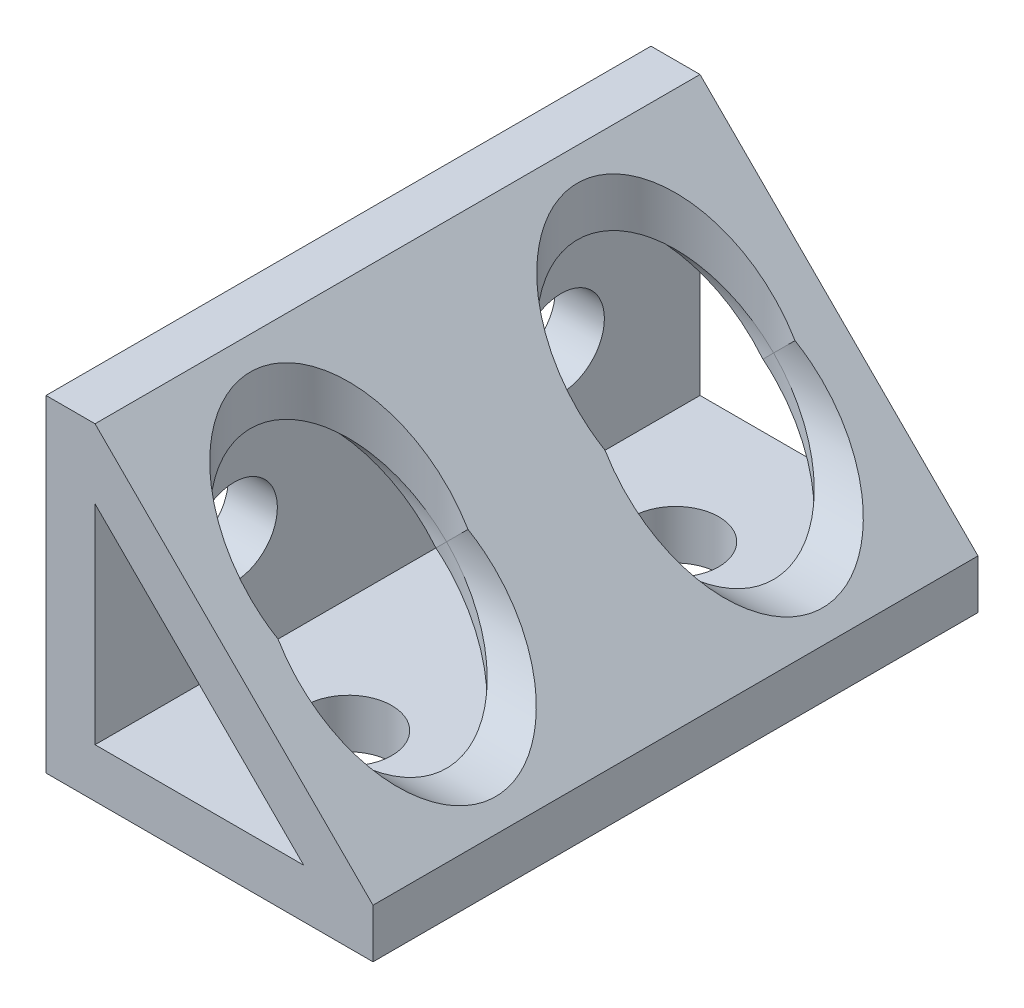
ISO-10303-21;
HEADER;
FILE_DESCRIPTION(('STEP AP214'),'2;1');
FILE_NAME('part.step','',(''),(''),'','','');
FILE_SCHEMA(('AUTOMOTIVE_DESIGN { 1 0 10303 214 1 1 1 1 }'));
ENDSEC;
DATA;
#1=APPLICATION_CONTEXT('core data for automotive mechanical design processes');
#2=APPLICATION_PROTOCOL_DEFINITION('international standard','automotive_design',2000,#1);
#3=PRODUCT_CONTEXT('',#1,'mechanical');
#4=PRODUCT('Part','Part','',(#3));
#5=PRODUCT_RELATED_PRODUCT_CATEGORY('part','',(#4));
#6=PRODUCT_DEFINITION_FORMATION('','',#4);
#7=PRODUCT_DEFINITION_CONTEXT('part definition',#1,'design');
#8=PRODUCT_DEFINITION('design','',#6,#7);
#9=PRODUCT_DEFINITION_SHAPE('','',#8);
#10=(LENGTH_UNIT() NAMED_UNIT(*) SI_UNIT(.MILLI.,.METRE.));
#11=(NAMED_UNIT(*) PLANE_ANGLE_UNIT() SI_UNIT($,.RADIAN.));
#12=(NAMED_UNIT(*) SI_UNIT($,.STERADIAN.) SOLID_ANGLE_UNIT());
#13=UNCERTAINTY_MEASURE_WITH_UNIT(LENGTH_MEASURE(1.E-05),#10,'distance_accuracy_value','');
#14=(GEOMETRIC_REPRESENTATION_CONTEXT(3) GLOBAL_UNCERTAINTY_ASSIGNED_CONTEXT((#13)) GLOBAL_UNIT_ASSIGNED_CONTEXT((#10,
#11,#12)) REPRESENTATION_CONTEXT('',''));
#15=CARTESIAN_POINT('',(0.,0.,0.));
#16=DIRECTION('',(0.,0.,1.));
#17=DIRECTION('',(1.,0.,0.));
#18=AXIS2_PLACEMENT_3D('',#15,#16,#17);
#19=CARTESIAN_POINT('',(5.75735931288071,-7.,-18.5));
#20=DIRECTION('',(0.707106781186548,0.707106781186547,0.));
#21=DIRECTION('',(-0.707106781186547,0.707106781186548,0.));
#22=AXIS2_PLACEMENT_3D('',#19,#20,#21);
#23=PLANE('',#22);
#24=CARTESIAN_POINT('',(-1.24264068711928,0.,-10.));
#25=DIRECTION('',(0.707106781186548,0.707106781186547,0.));
#26=DIRECTION('',(-0.707106781186547,0.707106781186548,0.));
#27=AXIS2_PLACEMENT_3D('',#24,#25,#26);
#28=ELLIPSE('',#27,8.48528137423856,6.);
#29=CARTESIAN_POINT('',(-7.,5.75735931288072,-11.689027454598));
#30=VERTEX_POINT('',#29);
#31=CARTESIAN_POINT('',(-0.621320343559641,-0.621320343559641,-15.9677433784203));
#32=VERTEX_POINT('',#31);
#33=EDGE_CURVE('E70',#30,#32,#28,.F.);
#34=ORIENTED_EDGE('',*,*,#33,.F.);
#35=DIRECTION('',(0.,0.,1.));
#36=VECTOR('',#35,1.);
#37=CARTESIAN_POINT('',(-7.,5.75735931288072,-18.5));
#38=LINE('',#37,#36);
#39=CARTESIAN_POINT('',(-7.,5.75735931288072,-18.5));
#40=VERTEX_POINT('',#39);
#41=EDGE_CURVE('E214',#40,#30,#38,.T.);
#42=ORIENTED_EDGE('',*,*,#41,.F.);
#43=DIRECTION('',(-0.707106781186548,0.707106781186548,0.));
#44=VECTOR('',#43,1.);
#45=CARTESIAN_POINT('',(5.75735931288071,-7.,-18.5));
#46=LINE('',#45,#44);
#47=CARTESIAN_POINT('',(5.75735931288071,-7.,-18.5));
#48=VERTEX_POINT('',#47);
#49=EDGE_CURVE('E252',#48,#40,#46,.T.);
#50=ORIENTED_EDGE('',*,*,#49,.F.);
#51=DIRECTION('',(0.,0.,1.));
#52=VECTOR('',#51,1.);
#53=CARTESIAN_POINT('',(5.75735931288071,-7.,-18.5));
#54=LINE('',#53,#52);
#55=CARTESIAN_POINT('',(5.75735931288071,-7.,-11.689027454598));
#56=VERTEX_POINT('',#55);
#57=EDGE_CURVE('E267',#48,#56,#54,.T.);
#58=ORIENTED_EDGE('',*,*,#57,.T.);
#59=CARTESIAN_POINT('',(0.,-1.24264068711928,-10.));
#60=DIRECTION('',(0.707106781186548,0.707106781186547,0.));
#61=DIRECTION('',(0.707106781186547,-0.707106781186548,0.));
#62=AXIS2_PLACEMENT_3D('',#59,#60,#61);
#63=ELLIPSE('',#62,8.48528137423856,6.);
#64=EDGE_CURVE('E218',#56,#32,#63,.T.);
#65=ORIENTED_EDGE('',*,*,#64,.T.);
#66=EDGE_LOOP('',(#34,#42,#50,#58,#65));
#67=FACE_BOUND('',#66,.T.);
#68=ADVANCED_FACE('F42',(#67),#23,.F.);
#69=CARTESIAN_POINT('',(-0.621320343559641,-0.621320343559641,-4.03225662157974));
#70=VERTEX_POINT('',#69);
#71=CARTESIAN_POINT('',(-7.,5.75735931288072,-8.31097254540204));
#72=VERTEX_POINT('',#71);
#73=EDGE_CURVE('E204',#70,#72,#28,.F.);
#74=ORIENTED_EDGE('',*,*,#73,.F.);
#75=CARTESIAN_POINT('',(5.75735931288071,-7.,-8.31097254540204));
#76=VERTEX_POINT('',#75);
#77=EDGE_CURVE('E353',#70,#76,#63,.T.);
#78=ORIENTED_EDGE('',*,*,#77,.T.);
#79=CARTESIAN_POINT('',(5.75735931288071,-7.,8.31097254540204));
#80=VERTEX_POINT('',#79);
#81=EDGE_CURVE('E269',#76,#80,#54,.T.);
#82=ORIENTED_EDGE('',*,*,#81,.T.);
#83=CARTESIAN_POINT('',(0.,-1.24264068711928,10.));
#84=DIRECTION('',(0.707106781186548,0.707106781186547,0.));
#85=DIRECTION('',(0.707106781186547,-0.707106781186548,0.));
#86=AXIS2_PLACEMENT_3D('',#83,#84,#85);
#87=ELLIPSE('',#86,8.48528137423856,6.);
#88=CARTESIAN_POINT('',(-0.621320343559641,-0.621320343559641,4.03225662157974));
#89=VERTEX_POINT('',#88);
#90=EDGE_CURVE('E321',#89,#80,#87,.F.);
#91=ORIENTED_EDGE('',*,*,#90,.F.);
#92=CARTESIAN_POINT('',(-1.24264068711928,0.,10.));
#93=DIRECTION('',(0.707106781186548,0.707106781186547,0.));
#94=DIRECTION('',(-0.707106781186547,0.707106781186548,0.));
#95=AXIS2_PLACEMENT_3D('',#92,#93,#94);
#96=ELLIPSE('',#95,8.48528137423856,6.);
#97=CARTESIAN_POINT('',(-7.,5.75735931288072,8.31097254540204));
#98=VERTEX_POINT('',#97);
#99=EDGE_CURVE('E341',#89,#98,#96,.T.);
#100=ORIENTED_EDGE('',*,*,#99,.T.);
#101=EDGE_CURVE('E229',#72,#98,#38,.T.);
#102=ORIENTED_EDGE('',*,*,#101,.F.);
#103=EDGE_LOOP('',(#74,#78,#82,#91,#100,#102));
#104=FACE_BOUND('',#103,.T.);
#105=ADVANCED_FACE('F393',(#104),#23,.F.);
#106=CARTESIAN_POINT('',(0.,10.,-10.));
#107=DIRECTION('',(0.,-1.,0.));
#108=DIRECTION('',(0.,0.,-1.));
#109=AXIS2_PLACEMENT_3D('',#106,#107,#108);
#110=CYLINDRICAL_SURFACE('',#109,6.);
#111=CARTESIAN_POINT('',(0.,0.,-10.));
#112=DIRECTION('',(-0.707106781186548,-0.707106781186547,0.));
#113=DIRECTION('',(0.707106781186547,-0.707106781186548,0.));
#114=AXIS2_PLACEMENT_3D('',#111,#112,#113);
#115=ELLIPSE('',#114,8.48528137423856,6.);
#116=CARTESIAN_POINT('',(0.,0.,-16.));
#117=VERTEX_POINT('',#116);
#118=CARTESIAN_POINT('',(0.,0.,-4.));
#119=VERTEX_POINT('',#118);
#120=EDGE_CURVE('E11',#117,#119,#115,.F.);
#121=ORIENTED_EDGE('',*,*,#120,.F.);
#122=CARTESIAN_POINT('',(0.,0.,-10.));
#123=DIRECTION('',(0.707106781186547,-0.707106781186548,0.));
#124=DIRECTION('',(-0.707106781186548,-0.707106781186547,0.));
#125=AXIS2_PLACEMENT_3D('',#122,#123,#124);
#126=ELLIPSE('',#125,8.48528137423856,6.);
#127=CARTESIAN_POINT('',(1.5,1.5,-15.8094750193111));
#128=VERTEX_POINT('',#127);
#129=EDGE_CURVE('E375',#128,#117,#126,.F.);
#130=ORIENTED_EDGE('',*,*,#129,.F.);
#131=CARTESIAN_POINT('',(0.,3.,-10.));
#132=DIRECTION('',(0.707106781186548,0.707106781186547,0.));
#133=DIRECTION('',(0.707106781186547,-0.707106781186548,0.));
#134=AXIS2_PLACEMENT_3D('',#131,#132,#133);
#135=ELLIPSE('',#134,8.48528137423856,6.);
#136=CARTESIAN_POINT('',(1.5,1.50000000000001,-4.19052498068888));
#137=VERTEX_POINT('',#136);
#138=EDGE_CURVE('E354',#128,#137,#135,.T.);
#139=ORIENTED_EDGE('',*,*,#138,.T.);
#140=EDGE_CURVE('E373',#119,#137,#126,.F.);
#141=ORIENTED_EDGE('',*,*,#140,.F.);
#142=EDGE_LOOP('',(#121,#130,#139,#141));
#143=FACE_BOUND('',#142,.T.);
#144=ADVANCED_FACE('F372',(#143),#110,.F.);
#145=CARTESIAN_POINT('',(0.,0.,-10.));
#146=DIRECTION('',(-0.707106781186548,-0.707106781186547,0.));
#147=DIRECTION('',(0.707106781186547,-0.707106781186548,0.));
#148=AXIS2_PLACEMENT_3D('',#145,#146,#147);
#149=ELLIPSE('',#148,8.48528137423856,6.);
#150=EDGE_CURVE('E51',#117,#119,#149,.T.);
#151=ORIENTED_EDGE('',*,*,#150,.F.);
#152=CARTESIAN_POINT('',(0.,0.,-10.));
#153=DIRECTION('',(0.707106781186547,-0.707106781186548,0.));
#154=DIRECTION('',(-0.707106781186548,-0.707106781186547,0.));
#155=AXIS2_PLACEMENT_3D('',#152,#153,#154);
#156=ELLIPSE('',#155,8.48528137423856,6.);
#157=EDGE_CURVE('E376',#32,#117,#156,.T.);
#158=ORIENTED_EDGE('',*,*,#157,.F.);
#159=ORIENTED_EDGE('',*,*,#64,.F.);
#160=CARTESIAN_POINT('',(0.,-7.,-10.));
#161=DIRECTION('',(0.,-1.,0.));
#162=DIRECTION('',(0.,0.,-1.));
#163=AXIS2_PLACEMENT_3D('',#160,#161,#162);
#164=CIRCLE('',#163,6.);
#165=EDGE_CURVE('E357',#56,#76,#164,.T.);
#166=ORIENTED_EDGE('',*,*,#165,.T.);
#167=ORIENTED_EDGE('',*,*,#77,.F.);
#168=EDGE_CURVE('E381',#119,#70,#156,.T.);
#169=ORIENTED_EDGE('',*,*,#168,.F.);
#170=EDGE_LOOP('',(#151,#158,#159,#166,#167,#169));
#171=FACE_BOUND('',#170,.T.);
#172=ADVANCED_FACE('F395',(#171),#110,.F.);
#173=CARTESIAN_POINT('',(-7.,5.75735931288072,11.689027454598));
#174=VERTEX_POINT('',#173);
#175=CARTESIAN_POINT('',(-7.,5.75735931288072,18.5));
#176=VERTEX_POINT('',#175);
#177=EDGE_CURVE('E231',#174,#176,#38,.T.);
#178=ORIENTED_EDGE('',*,*,#177,.F.);
#179=CARTESIAN_POINT('',(-0.621320343559641,-0.621320343559641,15.9677433784203));
#180=VERTEX_POINT('',#179);
#181=EDGE_CURVE('E331',#174,#180,#96,.T.);
#182=ORIENTED_EDGE('',*,*,#181,.T.);
#183=CARTESIAN_POINT('',(5.75735931288071,-7.,11.689027454598));
#184=VERTEX_POINT('',#183);
#185=EDGE_CURVE('E286',#184,#180,#87,.F.);
#186=ORIENTED_EDGE('',*,*,#185,.F.);
#187=CARTESIAN_POINT('',(5.75735931288071,-7.,18.5));
#188=VERTEX_POINT('',#187);
#189=EDGE_CURVE('E233',#184,#188,#54,.T.);
#190=ORIENTED_EDGE('',*,*,#189,.T.);
#191=DIRECTION('',(-0.707106781186548,0.707106781186548,0.));
#192=VECTOR('',#191,1.);
#193=CARTESIAN_POINT('',(5.75735931288071,-7.,18.5));
#194=LINE('',#193,#192);
#195=EDGE_CURVE('E256',#188,#176,#194,.T.);
#196=ORIENTED_EDGE('',*,*,#195,.T.);
#197=EDGE_LOOP('',(#178,#182,#186,#190,#196));
#198=FACE_BOUND('',#197,.T.);
#199=ADVANCED_FACE('F281',(#198),#23,.F.);
#200=CARTESIAN_POINT('',(0.,10.,10.));
#201=DIRECTION('',(0.,-1.,0.));
#202=DIRECTION('',(0.,0.,-1.));
#203=AXIS2_PLACEMENT_3D('',#200,#201,#202);
#204=CYLINDRICAL_SURFACE('',#203,6.);
#205=CARTESIAN_POINT('',(0.,0.,10.));
#206=DIRECTION('',(-0.707106781186548,-0.707106781186547,0.));
#207=DIRECTION('',(0.707106781186547,-0.707106781186548,0.));
#208=AXIS2_PLACEMENT_3D('',#205,#206,#207);
#209=ELLIPSE('',#208,8.48528137423856,6.);
#210=CARTESIAN_POINT('',(0.,0.,4.));
#211=VERTEX_POINT('',#210);
#212=CARTESIAN_POINT('',(0.,0.,16.));
#213=VERTEX_POINT('',#212);
#214=EDGE_CURVE('E377',#211,#213,#209,.F.);
#215=ORIENTED_EDGE('',*,*,#214,.F.);
#216=CARTESIAN_POINT('',(0.,0.,10.));
#217=DIRECTION('',(0.707106781186547,-0.707106781186548,0.));
#218=DIRECTION('',(-0.707106781186548,-0.707106781186547,0.));
#219=AXIS2_PLACEMENT_3D('',#216,#217,#218);
#220=ELLIPSE('',#219,8.48528137423856,6.);
#221=CARTESIAN_POINT('',(1.5,1.5,4.19052498068888));
#222=VERTEX_POINT('',#221);
#223=EDGE_CURVE('E397',#222,#211,#220,.F.);
#224=ORIENTED_EDGE('',*,*,#223,.F.);
#225=CARTESIAN_POINT('',(0.,3.,10.));
#226=DIRECTION('',(0.707106781186548,0.707106781186547,0.));
#227=DIRECTION('',(0.707106781186547,-0.707106781186548,0.));
#228=AXIS2_PLACEMENT_3D('',#225,#226,#227);
#229=ELLIPSE('',#228,8.48528137423856,6.);
#230=CARTESIAN_POINT('',(1.5,1.50000000000001,15.8094750193111));
#231=VERTEX_POINT('',#230);
#232=EDGE_CURVE('E309',#231,#222,#229,.F.);
#233=ORIENTED_EDGE('',*,*,#232,.F.);
#234=EDGE_CURVE('E403',#213,#231,#220,.F.);
#235=ORIENTED_EDGE('',*,*,#234,.F.);
#236=EDGE_LOOP('',(#215,#224,#233,#235));
#237=FACE_BOUND('',#236,.T.);
#238=ADVANCED_FACE('F425',(#237),#204,.F.);
#239=CARTESIAN_POINT('',(-7.,10.,-18.5));
#240=DIRECTION('',(0.,1.,0.));
#241=DIRECTION('',(0.,0.,1.));
#242=AXIS2_PLACEMENT_3D('',#239,#240,#241);
#243=PLANE('',#242);
#244=DIRECTION('',(-1.,0.,0.));
#245=VECTOR('',#244,1.);
#246=CARTESIAN_POINT('',(-7.,10.,18.5));
#247=LINE('',#246,#245);
#248=CARTESIAN_POINT('',(-7.,10.,18.5));
#249=VERTEX_POINT('',#248);
#250=CARTESIAN_POINT('',(-10.,10.,18.5));
#251=VERTEX_POINT('',#250);
#252=EDGE_CURVE('E268',#249,#251,#247,.T.);
#253=ORIENTED_EDGE('',*,*,#252,.F.);
#254=DIRECTION('',(0.,0.,1.));
#255=VECTOR('',#254,1.);
#256=CARTESIAN_POINT('',(-7.,10.,-18.5));
#257=LINE('',#256,#255);
#258=CARTESIAN_POINT('',(-7.,10.,-18.5));
#259=VERTEX_POINT('',#258);
#260=EDGE_CURVE('E401',#259,#249,#257,.T.);
#261=ORIENTED_EDGE('',*,*,#260,.F.);
#262=DIRECTION('',(-1.,0.,0.));
#263=VECTOR('',#262,1.);
#264=CARTESIAN_POINT('',(-7.,10.,-18.5));
#265=LINE('',#264,#263);
#266=CARTESIAN_POINT('',(-10.,10.,-18.5));
#267=VERTEX_POINT('',#266);
#268=EDGE_CURVE('E434',#259,#267,#265,.T.);
#269=ORIENTED_EDGE('',*,*,#268,.T.);
#270=DIRECTION('',(0.,0.,1.));
#271=VECTOR('',#270,1.);
#272=CARTESIAN_POINT('',(-10.,10.,-18.5));
#273=LINE('',#272,#271);
#274=EDGE_CURVE('E455',#267,#251,#273,.T.);
#275=ORIENTED_EDGE('',*,*,#274,.T.);
#276=EDGE_LOOP('',(#253,#261,#269,#275));
#277=FACE_BOUND('',#276,.T.);
#278=ADVANCED_FACE('F44',(#277),#243,.T.);
#279=CARTESIAN_POINT('',(10.,-7.,-18.5));
#280=DIRECTION('',(0.707106781186548,0.707106781186547,0.));
#281=DIRECTION('',(-0.707106781186547,0.707106781186548,0.));
#282=AXIS2_PLACEMENT_3D('',#279,#280,#281);
#283=PLANE('',#282);
#284=ORIENTED_EDGE('',*,*,#138,.F.);
#285=CARTESIAN_POINT('',(3.,0.,-10.));
#286=DIRECTION('',(0.707106781186548,0.707106781186547,0.));
#287=DIRECTION('',(-0.707106781186547,0.707106781186548,0.));
#288=AXIS2_PLACEMENT_3D('',#285,#286,#287);
#289=ELLIPSE('',#288,8.48528137423856,6.);
#290=EDGE_CURVE('E209',#128,#137,#289,.F.);
#291=ORIENTED_EDGE('',*,*,#290,.T.);
#292=EDGE_LOOP('',(#284,#291));
#293=FACE_BOUND('',#292,.T.);
#294=CARTESIAN_POINT('',(3.,0.,10.));
#295=DIRECTION('',(0.707106781186548,0.707106781186547,0.));
#296=DIRECTION('',(-0.707106781186547,0.707106781186548,0.));
#297=AXIS2_PLACEMENT_3D('',#294,#295,#296);
#298=ELLIPSE('',#297,8.48528137423856,6.);
#299=EDGE_CURVE('E345',#231,#222,#298,.T.);
#300=ORIENTED_EDGE('',*,*,#299,.F.);
#301=ORIENTED_EDGE('',*,*,#232,.T.);
#302=EDGE_LOOP('',(#300,#301));
#303=FACE_BOUND('',#302,.T.);
#304=DIRECTION('',(-0.707106781186547,0.707106781186548,0.));
#305=VECTOR('',#304,1.);
#306=CARTESIAN_POINT('',(10.,-7.,18.5));
#307=LINE('',#306,#305);
#308=CARTESIAN_POINT('',(10.,-7.,18.5));
#309=VERTEX_POINT('',#308);
#310=EDGE_CURVE('E431',#309,#249,#307,.T.);
#311=ORIENTED_EDGE('',*,*,#310,.F.);
#312=DIRECTION('',(0.,0.,1.));
#313=VECTOR('',#312,1.);
#314=CARTESIAN_POINT('',(10.,-7.,-18.5));
#315=LINE('',#314,#313);
#316=CARTESIAN_POINT('',(10.,-7.,-18.5));
#317=VERTEX_POINT('',#316);
#318=EDGE_CURVE('E437',#317,#309,#315,.T.);
#319=ORIENTED_EDGE('',*,*,#318,.F.);
#320=DIRECTION('',(-0.707106781186547,0.707106781186548,0.));
#321=VECTOR('',#320,1.);
#322=CARTESIAN_POINT('',(10.,-7.,-18.5));
#323=LINE('',#322,#321);
#324=EDGE_CURVE('E460',#317,#259,#323,.T.);
#325=ORIENTED_EDGE('',*,*,#324,.T.);
#326=ORIENTED_EDGE('',*,*,#260,.T.);
#327=EDGE_LOOP('',(#311,#319,#325,#326));
#328=FACE_BOUND('',#327,.T.);
#329=ADVANCED_FACE('F366',(#293,#303,#328),#283,.T.);
#330=CARTESIAN_POINT('',(10.,-10.,-18.5));
#331=DIRECTION('',(1.,0.,0.));
#332=DIRECTION('',(0.,0.,-1.));
#333=AXIS2_PLACEMENT_3D('',#330,#331,#332);
#334=PLANE('',#333);
#335=DIRECTION('',(0.,1.,0.));
#336=VECTOR('',#335,1.);
#337=CARTESIAN_POINT('',(10.,-10.,18.5));
#338=LINE('',#337,#336);
#339=CARTESIAN_POINT('',(10.,-10.,18.5));
#340=VERTEX_POINT('',#339);
#341=EDGE_CURVE('E435',#340,#309,#338,.T.);
#342=ORIENTED_EDGE('',*,*,#341,.F.);
#343=DIRECTION('',(0.,0.,1.));
#344=VECTOR('',#343,1.);
#345=CARTESIAN_POINT('',(10.,-10.,-18.5));
#346=LINE('',#345,#344);
#347=CARTESIAN_POINT('',(10.,-10.,-18.5));
#348=VERTEX_POINT('',#347);
#349=EDGE_CURVE('E439',#348,#340,#346,.T.);
#350=ORIENTED_EDGE('',*,*,#349,.F.);
#351=DIRECTION('',(0.,1.,0.));
#352=VECTOR('',#351,1.);
#353=CARTESIAN_POINT('',(10.,-10.,-18.5));
#354=LINE('',#353,#352);
#355=EDGE_CURVE('E468',#348,#317,#354,.T.);
#356=ORIENTED_EDGE('',*,*,#355,.T.);
#357=ORIENTED_EDGE('',*,*,#318,.T.);
#358=EDGE_LOOP('',(#342,#350,#356,#357));
#359=FACE_BOUND('',#358,.T.);
#360=ADVANCED_FACE('F481',(#359),#334,.T.);
#361=CARTESIAN_POINT('',(-10.,-10.,-18.5));
#362=DIRECTION('',(0.,-1.,0.));
#363=DIRECTION('',(0.,0.,-1.));
#364=AXIS2_PLACEMENT_3D('',#361,#362,#363);
#365=PLANE('',#364);
#366=CARTESIAN_POINT('',(0.,-10.,-10.));
#367=DIRECTION('',(0.,-1.,0.));
#368=DIRECTION('',(0.,0.,-1.));
#369=AXIS2_PLACEMENT_3D('',#366,#367,#368);
#370=CIRCLE('',#369,2.65);
#371=CARTESIAN_POINT('',(0.,-10.,-12.65));
#372=VERTEX_POINT('',#371);
#373=EDGE_CURVE('E260',#372,#372,#370,.T.);
#374=ORIENTED_EDGE('',*,*,#373,.F.);
#375=EDGE_LOOP('',(#374));
#376=FACE_BOUND('',#375,.T.);
#377=CARTESIAN_POINT('',(0.,-10.,10.));
#378=DIRECTION('',(0.,-1.,0.));
#379=DIRECTION('',(0.,0.,-1.));
#380=AXIS2_PLACEMENT_3D('',#377,#378,#379);
#381=CIRCLE('',#380,2.65);
#382=CARTESIAN_POINT('',(0.,-10.,7.35));
#383=VERTEX_POINT('',#382);
#384=EDGE_CURVE('E301',#383,#383,#381,.T.);
#385=ORIENTED_EDGE('',*,*,#384,.F.);
#386=EDGE_LOOP('',(#385));
#387=FACE_BOUND('',#386,.T.);
#388=DIRECTION('',(1.,0.,0.));
#389=VECTOR('',#388,1.);
#390=CARTESIAN_POINT('',(-10.,-10.,18.5));
#391=LINE('',#390,#389);
#392=CARTESIAN_POINT('',(-10.,-10.,18.5));
#393=VERTEX_POINT('',#392);
#394=EDGE_CURVE('E443',#393,#340,#391,.T.);
#395=ORIENTED_EDGE('',*,*,#394,.F.);
#396=DIRECTION('',(0.,0.,1.));
#397=VECTOR('',#396,1.);
#398=CARTESIAN_POINT('',(-10.,-10.,-18.5));
#399=LINE('',#398,#397);
#400=CARTESIAN_POINT('',(-10.,-10.,-18.5));
#401=VERTEX_POINT('',#400);
#402=EDGE_CURVE('E448',#401,#393,#399,.T.);
#403=ORIENTED_EDGE('',*,*,#402,.F.);
#404=DIRECTION('',(1.,0.,0.));
#405=VECTOR('',#404,1.);
#406=CARTESIAN_POINT('',(-10.,-10.,-18.5));
#407=LINE('',#406,#405);
#408=EDGE_CURVE('E473',#401,#348,#407,.T.);
#409=ORIENTED_EDGE('',*,*,#408,.T.);
#410=ORIENTED_EDGE('',*,*,#349,.T.);
#411=EDGE_LOOP('',(#395,#403,#409,#410));
#412=FACE_BOUND('',#411,.T.);
#413=ADVANCED_FACE('F491',(#376,#387,#412),#365,.T.);
#414=CARTESIAN_POINT('',(-10.,10.,-18.5));
#415=DIRECTION('',(-1.,0.,0.));
#416=DIRECTION('',(0.,-1.,0.));
#417=AXIS2_PLACEMENT_3D('',#414,#415,#416);
#418=PLANE('',#417);
#419=CARTESIAN_POINT('',(-10.,0.,-10.));
#420=DIRECTION('',(1.,0.,0.));
#421=DIRECTION('',(0.,0.,-1.));
#422=AXIS2_PLACEMENT_3D('',#419,#420,#421);
#423=CIRCLE('',#422,2.65);
#424=CARTESIAN_POINT('',(-10.,0.,-12.65));
#425=VERTEX_POINT('',#424);
#426=EDGE_CURVE('E334',#425,#425,#423,.T.);
#427=ORIENTED_EDGE('',*,*,#426,.T.);
#428=EDGE_LOOP('',(#427));
#429=FACE_BOUND('',#428,.T.);
#430=CARTESIAN_POINT('',(-10.,0.,10.));
#431=DIRECTION('',(1.,0.,0.));
#432=DIRECTION('',(0.,0.,-1.));
#433=AXIS2_PLACEMENT_3D('',#430,#431,#432);
#434=CIRCLE('',#433,2.65);
#435=CARTESIAN_POINT('',(-10.,0.,7.35));
#436=VERTEX_POINT('',#435);
#437=EDGE_CURVE('E330',#436,#436,#434,.T.);
#438=ORIENTED_EDGE('',*,*,#437,.T.);
#439=EDGE_LOOP('',(#438));
#440=FACE_BOUND('',#439,.T.);
#441=DIRECTION('',(0.,-1.,0.));
#442=VECTOR('',#441,1.);
#443=CARTESIAN_POINT('',(-10.,10.,18.5));
#444=LINE('',#443,#442);
#445=EDGE_CURVE('E273',#251,#393,#444,.T.);
#446=ORIENTED_EDGE('',*,*,#445,.F.);
#447=ORIENTED_EDGE('',*,*,#274,.F.);
#448=DIRECTION('',(0.,-1.,0.));
#449=VECTOR('',#448,1.);
#450=CARTESIAN_POINT('',(-10.,10.,-18.5));
#451=LINE('',#450,#449);
#452=EDGE_CURVE('E486',#267,#401,#451,.T.);
#453=ORIENTED_EDGE('',*,*,#452,.T.);
#454=ORIENTED_EDGE('',*,*,#402,.T.);
#455=EDGE_LOOP('',(#446,#447,#453,#454));
#456=FACE_BOUND('',#455,.T.);
#457=ADVANCED_FACE('F493',(#429,#440,#456),#418,.T.);
#458=CARTESIAN_POINT('',(0.,0.,-18.5));
#459=DIRECTION('',(0.,0.,1.));
#460=DIRECTION('',(1.,0.,0.));
#461=AXIS2_PLACEMENT_3D('',#458,#459,#460);
#462=PLANE('',#461);
#463=DIRECTION('',(1.,0.,0.));
#464=VECTOR('',#463,1.);
#465=CARTESIAN_POINT('',(-7.,-7.,-18.5));
#466=LINE('',#465,#464);
#467=CARTESIAN_POINT('',(-7.,-7.,-18.5));
#468=VERTEX_POINT('',#467);
#469=EDGE_CURVE('E238',#468,#48,#466,.T.);
#470=ORIENTED_EDGE('',*,*,#469,.T.);
#471=ORIENTED_EDGE('',*,*,#49,.T.);
#472=DIRECTION('',(0.,-1.,0.));
#473=VECTOR('',#472,1.);
#474=CARTESIAN_POINT('',(-7.,5.75735931288072,-18.5));
#475=LINE('',#474,#473);
#476=EDGE_CURVE('E225',#40,#468,#475,.T.);
#477=ORIENTED_EDGE('',*,*,#476,.T.);
#478=EDGE_LOOP('',(#470,#471,#477));
#479=FACE_BOUND('',#478,.T.);
#480=ORIENTED_EDGE('',*,*,#268,.F.);
#481=ORIENTED_EDGE('',*,*,#324,.F.);
#482=ORIENTED_EDGE('',*,*,#355,.F.);
#483=ORIENTED_EDGE('',*,*,#408,.F.);
#484=ORIENTED_EDGE('',*,*,#452,.F.);
#485=EDGE_LOOP('',(#480,#481,#482,#483,#484));
#486=FACE_BOUND('',#485,.T.);
#487=ADVANCED_FACE('F296',(#479,#486),#462,.F.);
#488=CARTESIAN_POINT('',(0.,0.,18.5));
#489=DIRECTION('',(0.,0.,1.));
#490=DIRECTION('',(1.,0.,0.));
#491=AXIS2_PLACEMENT_3D('',#488,#489,#490);
#492=PLANE('',#491);
#493=ORIENTED_EDGE('',*,*,#195,.F.);
#494=DIRECTION('',(1.,0.,0.));
#495=VECTOR('',#494,1.);
#496=CARTESIAN_POINT('',(-7.,-7.,18.5));
#497=LINE('',#496,#495);
#498=CARTESIAN_POINT('',(-7.,-7.,18.5));
#499=VERTEX_POINT('',#498);
#500=EDGE_CURVE('E263',#499,#188,#497,.T.);
#501=ORIENTED_EDGE('',*,*,#500,.F.);
#502=DIRECTION('',(0.,-1.,0.));
#503=VECTOR('',#502,1.);
#504=CARTESIAN_POINT('',(-7.,5.75735931288072,18.5));
#505=LINE('',#504,#503);
#506=EDGE_CURVE('E259',#176,#499,#505,.T.);
#507=ORIENTED_EDGE('',*,*,#506,.F.);
#508=EDGE_LOOP('',(#493,#501,#507));
#509=FACE_BOUND('',#508,.T.);
#510=ORIENTED_EDGE('',*,*,#252,.T.);
#511=ORIENTED_EDGE('',*,*,#445,.T.);
#512=ORIENTED_EDGE('',*,*,#394,.T.);
#513=ORIENTED_EDGE('',*,*,#341,.T.);
#514=ORIENTED_EDGE('',*,*,#310,.T.);
#515=EDGE_LOOP('',(#510,#511,#512,#513,#514));
#516=FACE_BOUND('',#515,.T.);
#517=ADVANCED_FACE('F294',(#509,#516),#492,.T.);
#518=CARTESIAN_POINT('',(-7.,-7.,-18.5));
#519=DIRECTION('',(0.,-1.,0.));
#520=DIRECTION('',(0.,0.,-1.));
#521=AXIS2_PLACEMENT_3D('',#518,#519,#520);
#522=PLANE('',#521);
#523=ORIENTED_EDGE('',*,*,#81,.F.);
#524=ORIENTED_EDGE('',*,*,#165,.F.);
#525=ORIENTED_EDGE('',*,*,#57,.F.);
#526=ORIENTED_EDGE('',*,*,#469,.F.);
#527=DIRECTION('',(0.,0.,1.));
#528=VECTOR('',#527,1.);
#529=CARTESIAN_POINT('',(-7.,-7.,-18.5));
#530=LINE('',#529,#528);
#531=EDGE_CURVE('E228',#468,#499,#530,.T.);
#532=ORIENTED_EDGE('',*,*,#531,.T.);
#533=ORIENTED_EDGE('',*,*,#500,.T.);
#534=ORIENTED_EDGE('',*,*,#189,.F.);
#535=CARTESIAN_POINT('',(0.,-7.,10.));
#536=DIRECTION('',(0.,1.,0.));
#537=DIRECTION('',(0.,0.,1.));
#538=AXIS2_PLACEMENT_3D('',#535,#536,#537);
#539=CIRCLE('',#538,6.);
#540=EDGE_CURVE('E322',#184,#80,#539,.T.);
#541=ORIENTED_EDGE('',*,*,#540,.T.);
#542=EDGE_LOOP('',(#523,#524,#525,#526,#532,#533,#534,#541));
#543=FACE_BOUND('',#542,.T.);
#544=CARTESIAN_POINT('',(0.,-7.,10.));
#545=DIRECTION('',(0.,-1.,0.));
#546=DIRECTION('',(0.,0.,-1.));
#547=AXIS2_PLACEMENT_3D('',#544,#545,#546);
#548=CIRCLE('',#547,2.65);
#549=CARTESIAN_POINT('',(0.,-7.,7.35));
#550=VERTEX_POINT('',#549);
#551=EDGE_CURVE('E305',#550,#550,#548,.F.);
#552=ORIENTED_EDGE('',*,*,#551,.F.);
#553=EDGE_LOOP('',(#552));
#554=FACE_BOUND('',#553,.T.);
#555=CARTESIAN_POINT('',(0.,-7.,-10.));
#556=DIRECTION('',(0.,-1.,0.));
#557=DIRECTION('',(0.,0.,-1.));
#558=AXIS2_PLACEMENT_3D('',#555,#556,#557);
#559=CIRCLE('',#558,2.65);
#560=CARTESIAN_POINT('',(0.,-7.,-12.65));
#561=VERTEX_POINT('',#560);
#562=EDGE_CURVE('E304',#561,#561,#559,.F.);
#563=ORIENTED_EDGE('',*,*,#562,.F.);
#564=EDGE_LOOP('',(#563));
#565=FACE_BOUND('',#564,.T.);
#566=ADVANCED_FACE('F291',(#543,#554,#565),#522,.F.);
#567=CARTESIAN_POINT('',(-7.,5.75735931288072,-18.5));
#568=DIRECTION('',(-1.,0.,0.));
#569=DIRECTION('',(0.,0.,1.));
#570=AXIS2_PLACEMENT_3D('',#567,#568,#569);
#571=PLANE('',#570);
#572=ORIENTED_EDGE('',*,*,#41,.T.);
#573=CARTESIAN_POINT('',(-7.,0.,-10.));
#574=DIRECTION('',(1.,0.,0.));
#575=DIRECTION('',(0.,0.,-1.));
#576=AXIS2_PLACEMENT_3D('',#573,#574,#575);
#577=CIRCLE('',#576,6.);
#578=EDGE_CURVE('E201',#30,#72,#577,.T.);
#579=ORIENTED_EDGE('',*,*,#578,.T.);
#580=ORIENTED_EDGE('',*,*,#101,.T.);
#581=CARTESIAN_POINT('',(-7.,0.,10.));
#582=DIRECTION('',(-1.,0.,0.));
#583=DIRECTION('',(0.,0.,1.));
#584=AXIS2_PLACEMENT_3D('',#581,#582,#583);
#585=CIRCLE('',#584,6.);
#586=EDGE_CURVE('E348',#174,#98,#585,.T.);
#587=ORIENTED_EDGE('',*,*,#586,.F.);
#588=ORIENTED_EDGE('',*,*,#177,.T.);
#589=ORIENTED_EDGE('',*,*,#506,.T.);
#590=ORIENTED_EDGE('',*,*,#531,.F.);
#591=ORIENTED_EDGE('',*,*,#476,.F.);
#592=EDGE_LOOP('',(#572,#579,#580,#587,#588,#589,#590,#591));
#593=FACE_BOUND('',#592,.T.);
#594=CARTESIAN_POINT('',(-7.,0.,10.));
#595=DIRECTION('',(-1.,0.,0.));
#596=DIRECTION('',(0.,0.,1.));
#597=AXIS2_PLACEMENT_3D('',#594,#595,#596);
#598=CIRCLE('',#597,2.65);
#599=CARTESIAN_POINT('',(-7.,0.,12.65));
#600=VERTEX_POINT('',#599);
#601=EDGE_CURVE('E326',#600,#600,#598,.T.);
#602=ORIENTED_EDGE('',*,*,#601,.T.);
#603=EDGE_LOOP('',(#602));
#604=FACE_BOUND('',#603,.T.);
#605=CARTESIAN_POINT('',(-7.,0.,-10.));
#606=DIRECTION('',(-1.,0.,0.));
#607=DIRECTION('',(0.,0.,1.));
#608=AXIS2_PLACEMENT_3D('',#605,#606,#607);
#609=CIRCLE('',#608,2.65);
#610=CARTESIAN_POINT('',(-7.,0.,-7.35));
#611=VERTEX_POINT('',#610);
#612=EDGE_CURVE('E325',#611,#611,#609,.T.);
#613=ORIENTED_EDGE('',*,*,#612,.T.);
#614=EDGE_LOOP('',(#613));
#615=FACE_BOUND('',#614,.T.);
#616=ADVANCED_FACE('F221',(#593,#604,#615),#571,.F.);
#617=CARTESIAN_POINT('',(0.,10.001,10.));
#618=DIRECTION('',(0.,-1.,0.));
#619=DIRECTION('',(0.,0.,-1.));
#620=AXIS2_PLACEMENT_3D('',#617,#618,#619);
#621=CYLINDRICAL_SURFACE('',#620,2.65);
#622=ORIENTED_EDGE('',*,*,#384,.T.);
#623=EDGE_LOOP('',(#622));
#624=FACE_BOUND('',#623,.T.);
#625=ORIENTED_EDGE('',*,*,#551,.T.);
#626=EDGE_LOOP('',(#625));
#627=FACE_BOUND('',#626,.T.);
#628=ADVANCED_FACE('F536',(#624,#627),#621,.F.);
#629=CARTESIAN_POINT('',(0.,10.001,-10.));
#630=DIRECTION('',(0.,-1.,0.));
#631=DIRECTION('',(0.,0.,-1.));
#632=AXIS2_PLACEMENT_3D('',#629,#630,#631);
#633=CYLINDRICAL_SURFACE('',#632,2.65);
#634=ORIENTED_EDGE('',*,*,#373,.T.);
#635=EDGE_LOOP('',(#634));
#636=FACE_BOUND('',#635,.T.);
#637=ORIENTED_EDGE('',*,*,#562,.T.);
#638=EDGE_LOOP('',(#637));
#639=FACE_BOUND('',#638,.T.);
#640=ADVANCED_FACE('F533',(#636,#639),#633,.F.);
#641=CARTESIAN_POINT('',(0.,0.,10.));
#642=DIRECTION('',(-0.707106781186548,-0.707106781186547,0.));
#643=DIRECTION('',(0.707106781186547,-0.707106781186548,0.));
#644=AXIS2_PLACEMENT_3D('',#641,#642,#643);
#645=ELLIPSE('',#644,8.48528137423856,6.);
#646=EDGE_CURVE('E384',#211,#213,#645,.T.);
#647=ORIENTED_EDGE('',*,*,#646,.F.);
#648=CARTESIAN_POINT('',(0.,0.,10.));
#649=DIRECTION('',(0.707106781186547,-0.707106781186548,0.));
#650=DIRECTION('',(-0.707106781186548,-0.707106781186547,0.));
#651=AXIS2_PLACEMENT_3D('',#648,#649,#650);
#652=ELLIPSE('',#651,8.48528137423856,6.);
#653=EDGE_CURVE('E400',#89,#211,#652,.T.);
#654=ORIENTED_EDGE('',*,*,#653,.F.);
#655=ORIENTED_EDGE('',*,*,#90,.T.);
#656=ORIENTED_EDGE('',*,*,#540,.F.);
#657=ORIENTED_EDGE('',*,*,#185,.T.);
#658=EDGE_CURVE('E405',#213,#180,#652,.T.);
#659=ORIENTED_EDGE('',*,*,#658,.F.);
#660=EDGE_LOOP('',(#647,#654,#655,#656,#657,#659));
#661=FACE_BOUND('',#660,.T.);
#662=ADVANCED_FACE('F426',(#661),#204,.F.);
#663=CARTESIAN_POINT('',(10.001,0.,10.));
#664=DIRECTION('',(-1.,0.,0.));
#665=DIRECTION('',(0.,-1.,0.));
#666=AXIS2_PLACEMENT_3D('',#663,#664,#665);
#667=CYLINDRICAL_SURFACE('',#666,2.65);
#668=ORIENTED_EDGE('',*,*,#437,.F.);
#669=EDGE_LOOP('',(#668));
#670=FACE_BOUND('',#669,.T.);
#671=ORIENTED_EDGE('',*,*,#601,.F.);
#672=EDGE_LOOP('',(#671));
#673=FACE_BOUND('',#672,.T.);
#674=ADVANCED_FACE('F527',(#670,#673),#667,.F.);
#675=CARTESIAN_POINT('',(10.001,0.,-10.));
#676=DIRECTION('',(-1.,0.,0.));
#677=DIRECTION('',(0.,-1.,0.));
#678=AXIS2_PLACEMENT_3D('',#675,#676,#677);
#679=CYLINDRICAL_SURFACE('',#678,2.65);
#680=ORIENTED_EDGE('',*,*,#426,.F.);
#681=EDGE_LOOP('',(#680));
#682=FACE_BOUND('',#681,.T.);
#683=ORIENTED_EDGE('',*,*,#612,.F.);
#684=EDGE_LOOP('',(#683));
#685=FACE_BOUND('',#684,.T.);
#686=ADVANCED_FACE('F524',(#682,#685),#679,.F.);
#687=CARTESIAN_POINT('',(10.,0.,10.));
#688=DIRECTION('',(-1.,0.,0.));
#689=DIRECTION('',(0.,-1.,0.));
#690=AXIS2_PLACEMENT_3D('',#687,#688,#689);
#691=CYLINDRICAL_SURFACE('',#690,6.);
#692=ORIENTED_EDGE('',*,*,#646,.T.);
#693=ORIENTED_EDGE('',*,*,#234,.T.);
#694=ORIENTED_EDGE('',*,*,#299,.T.);
#695=ORIENTED_EDGE('',*,*,#223,.T.);
#696=EDGE_LOOP('',(#692,#693,#694,#695));
#697=FACE_BOUND('',#696,.T.);
#698=ADVANCED_FACE('F416',(#697),#691,.F.);
#699=ORIENTED_EDGE('',*,*,#214,.T.);
#700=ORIENTED_EDGE('',*,*,#658,.T.);
#701=ORIENTED_EDGE('',*,*,#181,.F.);
#702=ORIENTED_EDGE('',*,*,#586,.T.);
#703=ORIENTED_EDGE('',*,*,#99,.F.);
#704=ORIENTED_EDGE('',*,*,#653,.T.);
#705=EDGE_LOOP('',(#699,#700,#701,#702,#703,#704));
#706=FACE_BOUND('',#705,.T.);
#707=ADVANCED_FACE('F422',(#706),#691,.F.);
#708=CARTESIAN_POINT('',(10.,0.,-10.));
#709=DIRECTION('',(-1.,0.,0.));
#710=DIRECTION('',(0.,-1.,0.));
#711=AXIS2_PLACEMENT_3D('',#708,#709,#710);
#712=CYLINDRICAL_SURFACE('',#711,6.);
#713=ORIENTED_EDGE('',*,*,#150,.T.);
#714=ORIENTED_EDGE('',*,*,#140,.T.);
#715=ORIENTED_EDGE('',*,*,#290,.F.);
#716=ORIENTED_EDGE('',*,*,#129,.T.);
#717=EDGE_LOOP('',(#713,#714,#715,#716));
#718=FACE_BOUND('',#717,.T.);
#719=ADVANCED_FACE('F577',(#718),#712,.F.);
#720=ORIENTED_EDGE('',*,*,#120,.T.);
#721=ORIENTED_EDGE('',*,*,#168,.T.);
#722=ORIENTED_EDGE('',*,*,#73,.T.);
#723=ORIENTED_EDGE('',*,*,#578,.F.);
#724=ORIENTED_EDGE('',*,*,#33,.T.);
#725=ORIENTED_EDGE('',*,*,#157,.T.);
#726=EDGE_LOOP('',(#720,#721,#722,#723,#724,#725));
#727=FACE_BOUND('',#726,.T.);
#728=ADVANCED_FACE('F202',(#727),#712,.F.);
#729=CLOSED_SHELL('',(#68,#105,#144,#172,#199,#238,#278,#329,#360,#413,#457,#487,#517,#566,#616,
#628,#640,#662,#674,#686,#698,#707,#719,#728));
#730=MANIFOLD_SOLID_BREP('B2',#729);
#731=ADVANCED_BREP_SHAPE_REPRESENTATION('',(#18,#730),#14);
#732=SHAPE_DEFINITION_REPRESENTATION(#9,#731);
ENDSEC;
END-ISO-10303-21;
